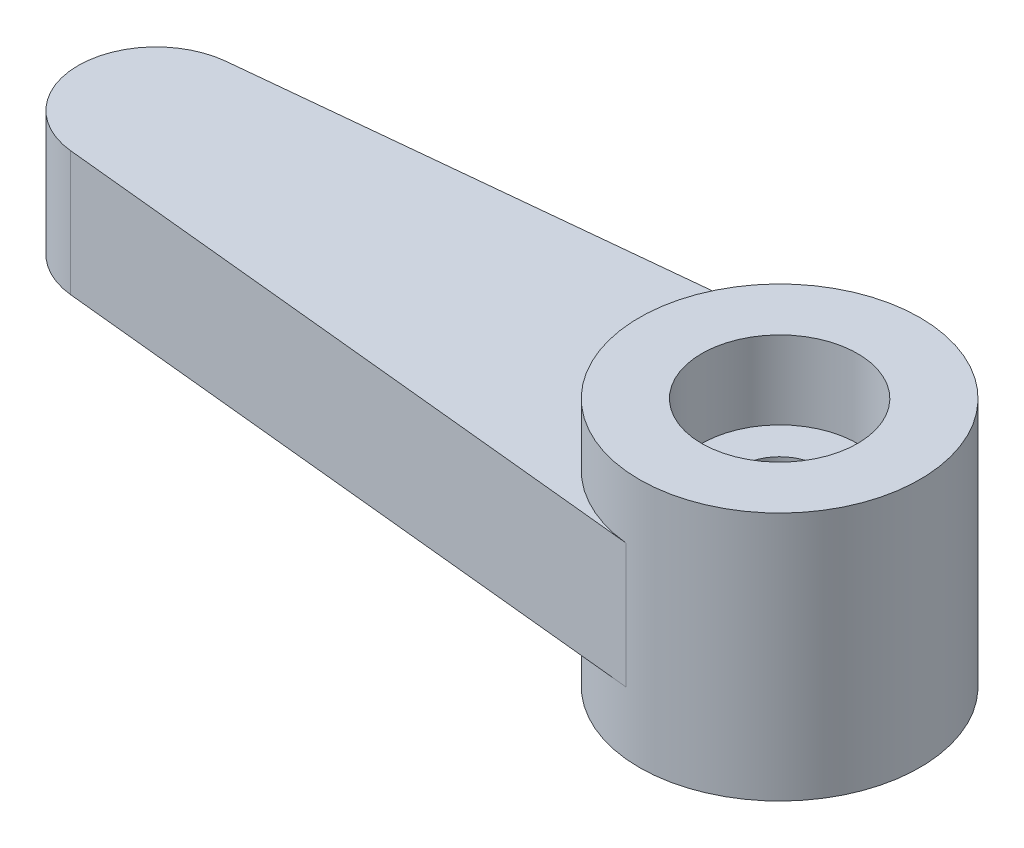
ISO-10303-21;
HEADER;
FILE_DESCRIPTION(('STEP AP214'),'2;1');
FILE_NAME('part.step','',(''),(''),'','','');
FILE_SCHEMA(('AUTOMOTIVE_DESIGN { 1 0 10303 214 1 1 1 1 }'));
ENDSEC;
DATA;
#1=APPLICATION_CONTEXT('core data for automotive mechanical design processes');
#2=APPLICATION_PROTOCOL_DEFINITION('international standard','automotive_design',2000,#1);
#3=PRODUCT_CONTEXT('',#1,'mechanical');
#4=PRODUCT('Part','Part','',(#3));
#5=PRODUCT_RELATED_PRODUCT_CATEGORY('part','',(#4));
#6=PRODUCT_DEFINITION_FORMATION('','',#4);
#7=PRODUCT_DEFINITION_CONTEXT('part definition',#1,'design');
#8=PRODUCT_DEFINITION('design','',#6,#7);
#9=PRODUCT_DEFINITION_SHAPE('','',#8);
#10=(LENGTH_UNIT() NAMED_UNIT(*) SI_UNIT(.MILLI.,.METRE.));
#11=(NAMED_UNIT(*) PLANE_ANGLE_UNIT() SI_UNIT($,.RADIAN.));
#12=(NAMED_UNIT(*) SI_UNIT($,.STERADIAN.) SOLID_ANGLE_UNIT());
#13=UNCERTAINTY_MEASURE_WITH_UNIT(LENGTH_MEASURE(1.E-05),#10,'distance_accuracy_value','');
#14=(GEOMETRIC_REPRESENTATION_CONTEXT(3) GLOBAL_UNCERTAINTY_ASSIGNED_CONTEXT((#13)) GLOBAL_UNIT_ASSIGNED_CONTEXT((#10,
#11,#12)) REPRESENTATION_CONTEXT('',''));
#15=CARTESIAN_POINT('',(0.,0.,0.));
#16=DIRECTION('',(0.,0.,1.));
#17=DIRECTION('',(1.,0.,0.));
#18=AXIS2_PLACEMENT_3D('',#15,#16,#17);
#19=CARTESIAN_POINT('',(0.,9.0546198939239,0.));
#20=DIRECTION('',(0.,1.,0.));
#21=DIRECTION('',(0.,0.,1.));
#22=AXIS2_PLACEMENT_3D('',#19,#20,#21);
#23=CYLINDRICAL_SURFACE('',#22,4.5);
#24=CARTESIAN_POINT('',(0.,-4.,0.));
#25=DIRECTION('',(0.,1.,0.));
#26=DIRECTION('',(0.,0.,1.));
#27=AXIS2_PLACEMENT_3D('',#24,#25,#26);
#28=CIRCLE('',#27,4.5);
#29=CARTESIAN_POINT('',(0.,-4.,4.5));
#30=VERTEX_POINT('',#29);
#31=EDGE_CURVE('E48',#30,#30,#28,.T.);
#32=ORIENTED_EDGE('',*,*,#31,.T.);
#33=EDGE_LOOP('',(#32));
#34=FACE_BOUND('',#33,.T.);
#35=CARTESIAN_POINT('',(0.,4.,0.));
#36=DIRECTION('',(0.,1.,0.));
#37=DIRECTION('',(0.,0.,1.));
#38=AXIS2_PLACEMENT_3D('',#35,#36,#37);
#39=CIRCLE('',#38,4.5);
#40=CARTESIAN_POINT('',(0.,4.,4.5));
#41=VERTEX_POINT('',#40);
#42=EDGE_CURVE('E11',#41,#41,#39,.T.);
#43=ORIENTED_EDGE('',*,*,#42,.F.);
#44=EDGE_LOOP('',(#43));
#45=FACE_BOUND('',#44,.T.);
#46=DIRECTION('',(0.,1.,0.));
#47=VECTOR('',#46,1.);
#48=CARTESIAN_POINT('',(-0.45,-2.,4.47744346697979));
#49=LINE('',#48,#47);
#50=CARTESIAN_POINT('',(-0.45,-2.,4.47744346697979));
#51=VERTEX_POINT('',#50);
#52=CARTESIAN_POINT('',(-0.45,2.,4.47744346697979));
#53=VERTEX_POINT('',#52);
#54=EDGE_CURVE('E60',#51,#53,#49,.T.);
#55=ORIENTED_EDGE('',*,*,#54,.F.);
#56=CARTESIAN_POINT('',(0.,-2.,0.));
#57=DIRECTION('',(0.,-1.,0.));
#58=DIRECTION('',(0.,0.,1.));
#59=AXIS2_PLACEMENT_3D('',#56,#57,#58);
#60=CIRCLE('',#59,4.5);
#61=CARTESIAN_POINT('',(-0.449999999999999,-2.,-4.47744346697979));
#62=VERTEX_POINT('',#61);
#63=EDGE_CURVE('E55',#51,#62,#60,.T.);
#64=ORIENTED_EDGE('',*,*,#63,.T.);
#65=DIRECTION('',(0.,1.,0.));
#66=VECTOR('',#65,1.);
#67=CARTESIAN_POINT('',(-0.449999999999999,-2.,-4.47744346697979));
#68=LINE('',#67,#66);
#69=CARTESIAN_POINT('',(-0.449999999999999,2.,-4.47744346697979));
#70=VERTEX_POINT('',#69);
#71=EDGE_CURVE('E125',#62,#70,#68,.T.);
#72=ORIENTED_EDGE('',*,*,#71,.T.);
#73=CARTESIAN_POINT('',(0.,2.,0.));
#74=DIRECTION('',(0.,-1.,0.));
#75=DIRECTION('',(0.,0.,1.));
#76=AXIS2_PLACEMENT_3D('',#73,#74,#75);
#77=CIRCLE('',#76,4.5);
#78=EDGE_CURVE('E98',#53,#70,#77,.T.);
#79=ORIENTED_EDGE('',*,*,#78,.F.);
#80=EDGE_LOOP('',(#55,#64,#72,#79));
#81=FACE_BOUND('',#80,.T.);
#82=ADVANCED_FACE('F39',(#34,#45,#81),#23,.T.);
#83=CARTESIAN_POINT('',(0.,4.,2.5));
#84=DIRECTION('',(0.,1.,0.));
#85=DIRECTION('',(0.,0.,1.));
#86=AXIS2_PLACEMENT_3D('',#83,#84,#85);
#87=PLANE('',#86);
#88=ORIENTED_EDGE('',*,*,#42,.T.);
#89=EDGE_LOOP('',(#88));
#90=FACE_BOUND('',#89,.T.);
#91=CARTESIAN_POINT('',(0.,4.,0.));
#92=DIRECTION('',(0.,1.,0.));
#93=DIRECTION('',(0.,0.,1.));
#94=AXIS2_PLACEMENT_3D('',#91,#92,#93);
#95=CIRCLE('',#94,2.5);
#96=CARTESIAN_POINT('',(0.,4.,2.5));
#97=VERTEX_POINT('',#96);
#98=EDGE_CURVE('E124',#97,#97,#95,.T.);
#99=ORIENTED_EDGE('',*,*,#98,.F.);
#100=EDGE_LOOP('',(#99));
#101=FACE_BOUND('',#100,.T.);
#102=ADVANCED_FACE('F41',(#90,#101),#87,.T.);
#103=CARTESIAN_POINT('',(0.,-4.,4.5));
#104=DIRECTION('',(0.,-1.,0.));
#105=DIRECTION('',(0.,0.,-1.));
#106=AXIS2_PLACEMENT_3D('',#103,#104,#105);
#107=PLANE('',#106);
#108=CARTESIAN_POINT('',(0.,-4.,0.));
#109=DIRECTION('',(0.,1.,0.));
#110=DIRECTION('',(0.,0.,1.));
#111=AXIS2_PLACEMENT_3D('',#108,#109,#110);
#112=CIRCLE('',#111,2.15888154833906);
#113=CARTESIAN_POINT('',(0.,-4.,2.15888154833906));
#114=VERTEX_POINT('',#113);
#115=EDGE_CURVE('E149',#114,#114,#112,.T.);
#116=ORIENTED_EDGE('',*,*,#115,.T.);
#117=EDGE_LOOP('',(#116));
#118=FACE_BOUND('',#117,.T.);
#119=ORIENTED_EDGE('',*,*,#31,.F.);
#120=EDGE_LOOP('',(#119));
#121=FACE_BOUND('',#120,.T.);
#122=ADVANCED_FACE('F158',(#118,#121),#107,.T.);
#123=CARTESIAN_POINT('',(0.,9.0546198939239,0.));
#124=DIRECTION('',(0.,1.,0.));
#125=DIRECTION('',(0.,0.,1.));
#126=AXIS2_PLACEMENT_3D('',#123,#124,#125);
#127=CYLINDRICAL_SURFACE('',#126,2.15888154833906);
#128=CARTESIAN_POINT('',(0.,-1.5,0.));
#129=DIRECTION('',(0.,1.,0.));
#130=DIRECTION('',(0.,0.,1.));
#131=AXIS2_PLACEMENT_3D('',#128,#129,#130);
#132=CIRCLE('',#131,2.15888154833906);
#133=CARTESIAN_POINT('',(0.,-1.5,2.15888154833906));
#134=VERTEX_POINT('',#133);
#135=EDGE_CURVE('E145',#134,#134,#132,.T.);
#136=ORIENTED_EDGE('',*,*,#135,.T.);
#137=EDGE_LOOP('',(#136));
#138=FACE_BOUND('',#137,.T.);
#139=ORIENTED_EDGE('',*,*,#115,.F.);
#140=EDGE_LOOP('',(#139));
#141=FACE_BOUND('',#140,.T.);
#142=ADVANCED_FACE('F160',(#138,#141),#127,.F.);
#143=CARTESIAN_POINT('',(0.,-1.5,2.15888154833906));
#144=DIRECTION('',(0.,-1.,0.));
#145=DIRECTION('',(0.,0.,-1.));
#146=AXIS2_PLACEMENT_3D('',#143,#144,#145);
#147=PLANE('',#146);
#148=CARTESIAN_POINT('',(0.,-1.5,0.));
#149=DIRECTION('',(0.,1.,0.));
#150=DIRECTION('',(0.,0.,1.));
#151=AXIS2_PLACEMENT_3D('',#148,#149,#150);
#152=CIRCLE('',#151,1.25);
#153=CARTESIAN_POINT('',(0.,-1.5,1.25));
#154=VERTEX_POINT('',#153);
#155=EDGE_CURVE('E141',#154,#154,#152,.T.);
#156=ORIENTED_EDGE('',*,*,#155,.T.);
#157=EDGE_LOOP('',(#156));
#158=FACE_BOUND('',#157,.T.);
#159=ORIENTED_EDGE('',*,*,#135,.F.);
#160=EDGE_LOOP('',(#159));
#161=FACE_BOUND('',#160,.T.);
#162=ADVANCED_FACE('F167',(#158,#161),#147,.T.);
#163=CARTESIAN_POINT('',(0.,9.0546198939239,0.));
#164=DIRECTION('',(0.,1.,0.));
#165=DIRECTION('',(0.,0.,1.));
#166=AXIS2_PLACEMENT_3D('',#163,#164,#165);
#167=CYLINDRICAL_SURFACE('',#166,1.25);
#168=CARTESIAN_POINT('',(0.,1.5,0.));
#169=DIRECTION('',(0.,1.,0.));
#170=DIRECTION('',(0.,0.,1.));
#171=AXIS2_PLACEMENT_3D('',#168,#169,#170);
#172=CIRCLE('',#171,1.25);
#173=CARTESIAN_POINT('',(0.,1.5,1.25));
#174=VERTEX_POINT('',#173);
#175=EDGE_CURVE('E137',#174,#174,#172,.T.);
#176=ORIENTED_EDGE('',*,*,#175,.T.);
#177=EDGE_LOOP('',(#176));
#178=FACE_BOUND('',#177,.T.);
#179=ORIENTED_EDGE('',*,*,#155,.F.);
#180=EDGE_LOOP('',(#179));
#181=FACE_BOUND('',#180,.T.);
#182=ADVANCED_FACE('F199',(#178,#181),#167,.F.);
#183=CARTESIAN_POINT('',(0.,1.5,1.25));
#184=DIRECTION('',(0.,1.,0.));
#185=DIRECTION('',(0.,0.,1.));
#186=AXIS2_PLACEMENT_3D('',#183,#184,#185);
#187=PLANE('',#186);
#188=CARTESIAN_POINT('',(0.,1.5,0.));
#189=DIRECTION('',(0.,1.,0.));
#190=DIRECTION('',(0.,0.,1.));
#191=AXIS2_PLACEMENT_3D('',#188,#189,#190);
#192=CIRCLE('',#191,2.5);
#193=CARTESIAN_POINT('',(0.,1.5,2.5));
#194=VERTEX_POINT('',#193);
#195=EDGE_CURVE('E133',#194,#194,#192,.T.);
#196=ORIENTED_EDGE('',*,*,#195,.T.);
#197=EDGE_LOOP('',(#196));
#198=FACE_BOUND('',#197,.T.);
#199=ORIENTED_EDGE('',*,*,#175,.F.);
#200=EDGE_LOOP('',(#199));
#201=FACE_BOUND('',#200,.T.);
#202=ADVANCED_FACE('F209',(#198,#201),#187,.T.);
#203=CARTESIAN_POINT('',(0.,9.0546198939239,0.));
#204=DIRECTION('',(0.,1.,0.));
#205=DIRECTION('',(0.,0.,1.));
#206=AXIS2_PLACEMENT_3D('',#203,#204,#205);
#207=CYLINDRICAL_SURFACE('',#206,2.5);
#208=ORIENTED_EDGE('',*,*,#98,.T.);
#209=EDGE_LOOP('',(#208));
#210=FACE_BOUND('',#209,.T.);
#211=ORIENTED_EDGE('',*,*,#195,.F.);
#212=EDGE_LOOP('',(#211));
#213=FACE_BOUND('',#212,.T.);
#214=ADVANCED_FACE('F218',(#210,#213),#207,.F.);
#215=CARTESIAN_POINT('',(-20.,-2.,0.));
#216=DIRECTION('',(0.,1.,0.));
#217=DIRECTION('',(0.,0.,1.));
#218=AXIS2_PLACEMENT_3D('',#215,#216,#217);
#219=CYLINDRICAL_SURFACE('',#218,2.5);
#220=DIRECTION('',(0.,1.,0.));
#221=VECTOR('',#220,1.);
#222=CARTESIAN_POINT('',(-20.25,-2.,2.48746859276655));
#223=LINE('',#222,#221);
#224=CARTESIAN_POINT('',(-20.25,-2.,2.48746859276655));
#225=VERTEX_POINT('',#224);
#226=CARTESIAN_POINT('',(-20.25,2.,2.48746859276655));
#227=VERTEX_POINT('',#226);
#228=EDGE_CURVE('E79',#225,#227,#223,.T.);
#229=ORIENTED_EDGE('',*,*,#228,.T.);
#230=CARTESIAN_POINT('',(-20.,2.,0.));
#231=DIRECTION('',(0.,1.,0.));
#232=DIRECTION('',(0.,0.,1.));
#233=AXIS2_PLACEMENT_3D('',#230,#231,#232);
#234=CIRCLE('',#233,2.5);
#235=CARTESIAN_POINT('',(-20.25,2.,-2.48746859276655));
#236=VERTEX_POINT('',#235);
#237=EDGE_CURVE('E83',#236,#227,#234,.T.);
#238=ORIENTED_EDGE('',*,*,#237,.F.);
#239=DIRECTION('',(0.,1.,0.));
#240=VECTOR('',#239,1.);
#241=CARTESIAN_POINT('',(-20.25,-2.,-2.48746859276655));
#242=LINE('',#241,#240);
#243=CARTESIAN_POINT('',(-20.25,-2.,-2.48746859276655));
#244=VERTEX_POINT('',#243);
#245=EDGE_CURVE('E121',#244,#236,#242,.T.);
#246=ORIENTED_EDGE('',*,*,#245,.F.);
#247=CARTESIAN_POINT('',(-20.,-2.,0.));
#248=DIRECTION('',(0.,1.,0.));
#249=DIRECTION('',(0.,0.,1.));
#250=AXIS2_PLACEMENT_3D('',#247,#248,#249);
#251=CIRCLE('',#250,2.5);
#252=EDGE_CURVE('E85',#244,#225,#251,.T.);
#253=ORIENTED_EDGE('',*,*,#252,.T.);
#254=EDGE_LOOP('',(#229,#238,#246,#253));
#255=FACE_BOUND('',#254,.T.);
#256=ADVANCED_FACE('F81',(#255),#219,.T.);
#257=CARTESIAN_POINT('',(-20.25,-2.,-2.48746859276655));
#258=DIRECTION('',(-0.0999999999999999,0.,-0.99498743710662));
#259=DIRECTION('',(-0.99498743710662,0.,0.0999999999999999));
#260=AXIS2_PLACEMENT_3D('',#257,#258,#259);
#261=PLANE('',#260);
#262=ORIENTED_EDGE('',*,*,#245,.T.);
#263=DIRECTION('',(-0.99498743710662,0.,0.0999999999999999));
#264=VECTOR('',#263,1.);
#265=CARTESIAN_POINT('',(-20.25,2.,-2.48746859276655));
#266=LINE('',#265,#264);
#267=EDGE_CURVE('E103',#70,#236,#266,.T.);
#268=ORIENTED_EDGE('',*,*,#267,.F.);
#269=ORIENTED_EDGE('',*,*,#71,.F.);
#270=DIRECTION('',(-0.99498743710662,0.,0.0999999999999999));
#271=VECTOR('',#270,1.);
#272=CARTESIAN_POINT('',(-20.25,-2.,-2.48746859276655));
#273=LINE('',#272,#271);
#274=EDGE_CURVE('E90',#62,#244,#273,.T.);
#275=ORIENTED_EDGE('',*,*,#274,.T.);
#276=EDGE_LOOP('',(#262,#268,#269,#275));
#277=FACE_BOUND('',#276,.T.);
#278=ADVANCED_FACE('F235',(#277),#261,.T.);
#279=CARTESIAN_POINT('',(-0.45,-2.,4.47744346697979));
#280=DIRECTION('',(-0.1,0.,0.99498743710662));
#281=DIRECTION('',(0.99498743710662,0.,0.1));
#282=AXIS2_PLACEMENT_3D('',#279,#280,#281);
#283=PLANE('',#282);
#284=ORIENTED_EDGE('',*,*,#54,.T.);
#285=DIRECTION('',(0.99498743710662,0.,0.1));
#286=VECTOR('',#285,1.);
#287=CARTESIAN_POINT('',(-0.45,2.,4.47744346697979));
#288=LINE('',#287,#286);
#289=EDGE_CURVE('E93',#227,#53,#288,.T.);
#290=ORIENTED_EDGE('',*,*,#289,.F.);
#291=ORIENTED_EDGE('',*,*,#228,.F.);
#292=DIRECTION('',(0.99498743710662,0.,0.1));
#293=VECTOR('',#292,1.);
#294=CARTESIAN_POINT('',(-0.45,-2.,4.47744346697979));
#295=LINE('',#294,#293);
#296=EDGE_CURVE('E113',#225,#51,#295,.T.);
#297=ORIENTED_EDGE('',*,*,#296,.T.);
#298=EDGE_LOOP('',(#284,#290,#291,#297));
#299=FACE_BOUND('',#298,.T.);
#300=ADVANCED_FACE('F94',(#299),#283,.T.);
#301=CARTESIAN_POINT('',(-20.,-2.,0.));
#302=DIRECTION('',(0.,1.,0.));
#303=DIRECTION('',(0.,0.,1.));
#304=AXIS2_PLACEMENT_3D('',#301,#302,#303);
#305=PLANE('',#304);
#306=ORIENTED_EDGE('',*,*,#252,.F.);
#307=ORIENTED_EDGE('',*,*,#274,.F.);
#308=ORIENTED_EDGE('',*,*,#63,.F.);
#309=ORIENTED_EDGE('',*,*,#296,.F.);
#310=EDGE_LOOP('',(#306,#307,#308,#309));
#311=FACE_BOUND('',#310,.T.);
#312=ADVANCED_FACE('F249',(#311),#305,.F.);
#313=CARTESIAN_POINT('',(-20.,2.,0.));
#314=DIRECTION('',(0.,1.,0.));
#315=DIRECTION('',(0.,0.,1.));
#316=AXIS2_PLACEMENT_3D('',#313,#314,#315);
#317=PLANE('',#316);
#318=ORIENTED_EDGE('',*,*,#237,.T.);
#319=ORIENTED_EDGE('',*,*,#289,.T.);
#320=ORIENTED_EDGE('',*,*,#78,.T.);
#321=ORIENTED_EDGE('',*,*,#267,.T.);
#322=EDGE_LOOP('',(#318,#319,#320,#321));
#323=FACE_BOUND('',#322,.T.);
#324=ADVANCED_FACE('F101',(#323),#317,.T.);
#325=CLOSED_SHELL('',(#82,#102,#122,#142,#162,#182,#202,#214,#256,#278,#300,#312,#324));
#326=MANIFOLD_SOLID_BREP('B2',#325);
#327=ADVANCED_BREP_SHAPE_REPRESENTATION('',(#18,#326),#14);
#328=SHAPE_DEFINITION_REPRESENTATION(#9,#327);
ENDSEC;
END-ISO-10303-21;
